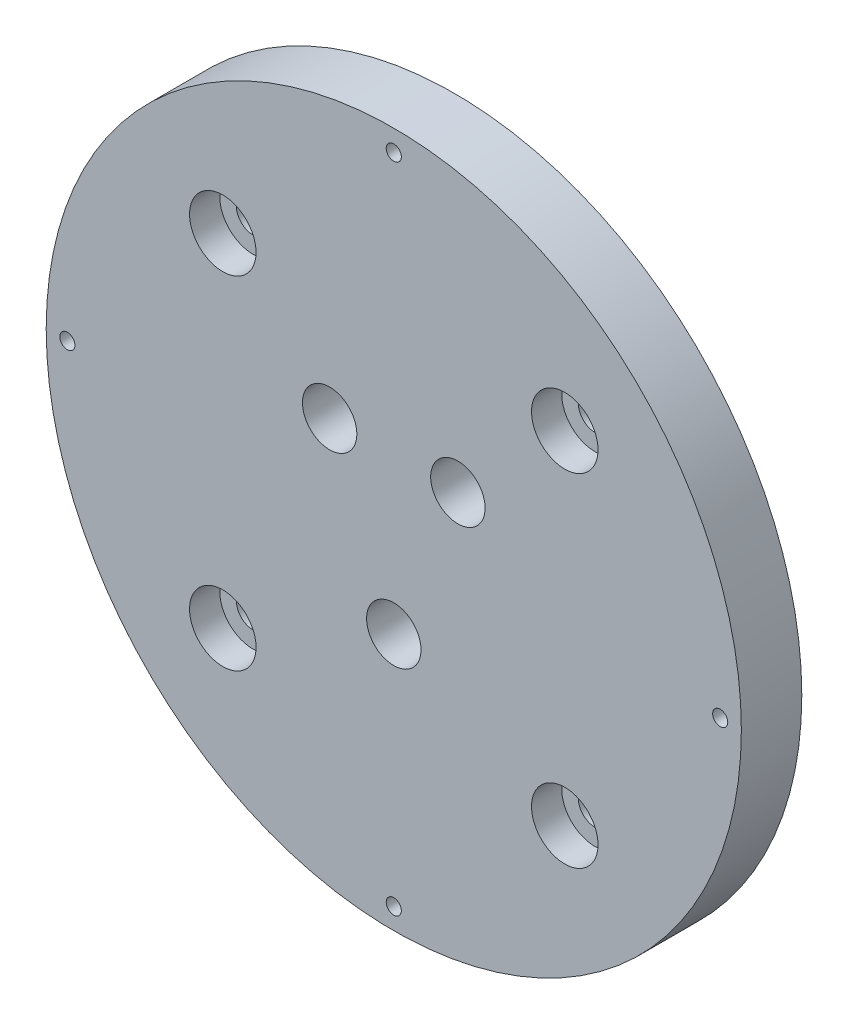
ISO-10303-21;
HEADER;
FILE_DESCRIPTION(('STEP AP214'),'2;1');
FILE_NAME('part.step','',(''),(''),'','','');
FILE_SCHEMA(('AUTOMOTIVE_DESIGN { 1 0 10303 214 1 1 1 1 }'));
ENDSEC;
DATA;
#1=APPLICATION_CONTEXT('core data for automotive mechanical design processes');
#2=APPLICATION_PROTOCOL_DEFINITION('international standard','automotive_design',2000,#1);
#3=PRODUCT_CONTEXT('',#1,'mechanical');
#4=PRODUCT('Part','Part','',(#3));
#5=PRODUCT_RELATED_PRODUCT_CATEGORY('part','',(#4));
#6=PRODUCT_DEFINITION_FORMATION('','',#4);
#7=PRODUCT_DEFINITION_CONTEXT('part definition',#1,'design');
#8=PRODUCT_DEFINITION('design','',#6,#7);
#9=PRODUCT_DEFINITION_SHAPE('','',#8);
#10=(LENGTH_UNIT() NAMED_UNIT(*) SI_UNIT(.MILLI.,.METRE.));
#11=(NAMED_UNIT(*) PLANE_ANGLE_UNIT() SI_UNIT($,.RADIAN.));
#12=(NAMED_UNIT(*) SI_UNIT($,.STERADIAN.) SOLID_ANGLE_UNIT());
#13=UNCERTAINTY_MEASURE_WITH_UNIT(LENGTH_MEASURE(1.E-05),#10,'distance_accuracy_value','');
#14=(GEOMETRIC_REPRESENTATION_CONTEXT(3) GLOBAL_UNCERTAINTY_ASSIGNED_CONTEXT((#13)) GLOBAL_UNIT_ASSIGNED_CONTEXT((#10,
#11,#12)) REPRESENTATION_CONTEXT('',''));
#15=CARTESIAN_POINT('',(0.,0.,0.));
#16=DIRECTION('',(0.,0.,1.));
#17=DIRECTION('',(1.,0.,0.));
#18=AXIS2_PLACEMENT_3D('',#15,#16,#17);
#19=CARTESIAN_POINT('',(0.,0.,0.));
#20=DIRECTION('',(0.,0.,1.));
#21=DIRECTION('',(1.,0.,0.));
#22=AXIS2_PLACEMENT_3D('',#19,#20,#21);
#23=PLANE('',#22);
#24=CARTESIAN_POINT('',(28.2842712474622,-28.2842712474616,0.));
#25=DIRECTION('',(0.,0.,1.));
#26=DIRECTION('',(1.,0.,0.));
#27=AXIS2_PLACEMENT_3D('',#24,#25,#26);
#28=CIRCLE('',#27,2.75000000000001);
#29=CARTESIAN_POINT('',(31.0342712474623,-28.2842712474616,0.));
#30=VERTEX_POINT('',#29);
#31=EDGE_CURVE('E157',#30,#30,#28,.T.);
#32=ORIENTED_EDGE('',*,*,#31,.T.);
#33=EDGE_LOOP('',(#32));
#34=FACE_BOUND('',#33,.T.);
#35=CARTESIAN_POINT('',(-28.2842712474618,-28.284271247462,0.));
#36=DIRECTION('',(0.,0.,1.));
#37=DIRECTION('',(1.,0.,0.));
#38=AXIS2_PLACEMENT_3D('',#35,#36,#37);
#39=CIRCLE('',#38,2.75000000000001);
#40=CARTESIAN_POINT('',(-25.5342712474618,-28.284271247462,0.));
#41=VERTEX_POINT('',#40);
#42=EDGE_CURVE('E161',#41,#41,#39,.T.);
#43=ORIENTED_EDGE('',*,*,#42,.T.);
#44=EDGE_LOOP('',(#43));
#45=FACE_BOUND('',#44,.T.);
#46=CARTESIAN_POINT('',(-28.2842712474621,28.2842712474617,0.));
#47=DIRECTION('',(0.,0.,1.));
#48=DIRECTION('',(1.,0.,0.));
#49=AXIS2_PLACEMENT_3D('',#46,#47,#48);
#50=CIRCLE('',#49,2.75000000000001);
#51=CARTESIAN_POINT('',(-25.534271247462,28.2842712474617,0.));
#52=VERTEX_POINT('',#51);
#53=EDGE_CURVE('E165',#52,#52,#50,.T.);
#54=ORIENTED_EDGE('',*,*,#53,.T.);
#55=EDGE_LOOP('',(#54));
#56=FACE_BOUND('',#55,.T.);
#57=CARTESIAN_POINT('',(28.2842712474618,28.284271247462,0.));
#58=DIRECTION('',(0.,0.,1.));
#59=DIRECTION('',(1.,0.,0.));
#60=AXIS2_PLACEMENT_3D('',#57,#58,#59);
#61=CIRCLE('',#60,2.75000000000001);
#62=CARTESIAN_POINT('',(31.0342712474619,28.284271247462,0.));
#63=VERTEX_POINT('',#62);
#64=EDGE_CURVE('E77',#63,#63,#61,.T.);
#65=ORIENTED_EDGE('',*,*,#64,.T.);
#66=EDGE_LOOP('',(#65));
#67=FACE_BOUND('',#66,.T.);
#68=CARTESIAN_POINT('',(-10.6066017177983,10.6066017177982,0.));
#69=DIRECTION('',(0.,0.,1.));
#70=DIRECTION('',(1.,0.,0.));
#71=AXIS2_PLACEMENT_3D('',#68,#69,#70);
#72=CIRCLE('',#71,4.5);
#73=CARTESIAN_POINT('',(-6.10660171779827,10.6066017177982,0.));
#74=VERTEX_POINT('',#73);
#75=EDGE_CURVE('E120',#74,#74,#72,.T.);
#76=ORIENTED_EDGE('',*,*,#75,.T.);
#77=EDGE_LOOP('',(#76));
#78=FACE_BOUND('',#77,.T.);
#79=CARTESIAN_POINT('',(10.6066017177982,10.6066017177982,0.));
#80=DIRECTION('',(0.,0.,1.));
#81=DIRECTION('',(1.,0.,0.));
#82=AXIS2_PLACEMENT_3D('',#79,#80,#81);
#83=CIRCLE('',#82,4.5);
#84=CARTESIAN_POINT('',(15.1066017177982,10.6066017177982,0.));
#85=VERTEX_POINT('',#84);
#86=EDGE_CURVE('E114',#85,#85,#83,.T.);
#87=ORIENTED_EDGE('',*,*,#86,.T.);
#88=EDGE_LOOP('',(#87));
#89=FACE_BOUND('',#88,.T.);
#90=CARTESIAN_POINT('',(0.,-15.,0.));
#91=DIRECTION('',(0.,0.,1.));
#92=DIRECTION('',(1.,0.,0.));
#93=AXIS2_PLACEMENT_3D('',#90,#91,#92);
#94=CIRCLE('',#93,4.5);
#95=CARTESIAN_POINT('',(4.5,-15.,0.));
#96=VERTEX_POINT('',#95);
#97=EDGE_CURVE('E108',#96,#96,#94,.T.);
#98=ORIENTED_EDGE('',*,*,#97,.T.);
#99=EDGE_LOOP('',(#98));
#100=FACE_BOUND('',#99,.T.);
#101=CARTESIAN_POINT('',(0.,0.,0.));
#102=DIRECTION('',(0.,0.,-1.));
#103=DIRECTION('',(-1.,0.,0.));
#104=AXIS2_PLACEMENT_3D('',#101,#102,#103);
#105=CIRCLE('',#104,53.);
#106=CARTESIAN_POINT('',(-53.,0.,0.));
#107=VERTEX_POINT('',#106);
#108=EDGE_CURVE('E95',#107,#107,#105,.T.);
#109=ORIENTED_EDGE('',*,*,#108,.T.);
#110=EDGE_LOOP('',(#109));
#111=FACE_BOUND('',#110,.T.);
#112=ADVANCED_FACE('F39',(#34,#45,#56,#67,#78,#89,#100,#111),#23,.F.);
#113=CARTESIAN_POINT('',(0.,0.,10.));
#114=DIRECTION('',(0.,0.,-1.));
#115=DIRECTION('',(-1.,0.,0.));
#116=AXIS2_PLACEMENT_3D('',#113,#114,#115);
#117=CYLINDRICAL_SURFACE('',#116,57.5);
#118=CARTESIAN_POINT('',(0.,0.,10.));
#119=DIRECTION('',(0.,0.,1.));
#120=DIRECTION('',(1.,0.,0.));
#121=AXIS2_PLACEMENT_3D('',#118,#119,#120);
#122=CIRCLE('',#121,57.5);
#123=CARTESIAN_POINT('',(57.5,0.,10.));
#124=VERTEX_POINT('',#123);
#125=EDGE_CURVE('E11',#124,#124,#122,.T.);
#126=ORIENTED_EDGE('',*,*,#125,.F.);
#127=EDGE_LOOP('',(#126));
#128=FACE_BOUND('',#127,.T.);
#129=CARTESIAN_POINT('',(0.,0.,0.));
#130=DIRECTION('',(0.,0.,1.));
#131=DIRECTION('',(1.,0.,0.));
#132=AXIS2_PLACEMENT_3D('',#129,#130,#131);
#133=CIRCLE('',#132,57.5);
#134=CARTESIAN_POINT('',(57.5,0.,0.));
#135=VERTEX_POINT('',#134);
#136=EDGE_CURVE('E43',#135,#135,#133,.T.);
#137=ORIENTED_EDGE('',*,*,#136,.T.);
#138=EDGE_LOOP('',(#137));
#139=FACE_BOUND('',#138,.T.);
#140=ADVANCED_FACE('F41',(#128,#139),#117,.T.);
#141=CARTESIAN_POINT('',(0.,0.,10.));
#142=DIRECTION('',(0.,0.,1.));
#143=DIRECTION('',(1.,0.,0.));
#144=AXIS2_PLACEMENT_3D('',#141,#142,#143);
#145=PLANE('',#144);
#146=CARTESIAN_POINT('',(28.2842712474622,-28.2842712474616,10.));
#147=DIRECTION('',(0.,0.,1.));
#148=DIRECTION('',(1.,0.,0.));
#149=AXIS2_PLACEMENT_3D('',#146,#147,#148);
#150=CIRCLE('',#149,5.50000000000001);
#151=CARTESIAN_POINT('',(33.7842712474623,-28.2842712474616,10.));
#152=VERTEX_POINT('',#151);
#153=EDGE_CURVE('E442',#152,#152,#150,.T.);
#154=ORIENTED_EDGE('',*,*,#153,.F.);
#155=EDGE_LOOP('',(#154));
#156=FACE_BOUND('',#155,.T.);
#157=CARTESIAN_POINT('',(-28.2842712474618,-28.284271247462,10.));
#158=DIRECTION('',(0.,0.,1.));
#159=DIRECTION('',(1.,0.,0.));
#160=AXIS2_PLACEMENT_3D('',#157,#158,#159);
#161=CIRCLE('',#160,5.50000000000001);
#162=CARTESIAN_POINT('',(-22.7842712474618,-28.284271247462,10.));
#163=VERTEX_POINT('',#162);
#164=EDGE_CURVE('E450',#163,#163,#161,.T.);
#165=ORIENTED_EDGE('',*,*,#164,.F.);
#166=EDGE_LOOP('',(#165));
#167=FACE_BOUND('',#166,.T.);
#168=CARTESIAN_POINT('',(-28.2842712474621,28.2842712474617,10.));
#169=DIRECTION('',(0.,0.,1.));
#170=DIRECTION('',(1.,0.,0.));
#171=AXIS2_PLACEMENT_3D('',#168,#169,#170);
#172=CIRCLE('',#171,5.50000000000001);
#173=CARTESIAN_POINT('',(-22.784271247462,28.2842712474617,10.));
#174=VERTEX_POINT('',#173);
#175=EDGE_CURVE('E460',#174,#174,#172,.T.);
#176=ORIENTED_EDGE('',*,*,#175,.F.);
#177=EDGE_LOOP('',(#176));
#178=FACE_BOUND('',#177,.T.);
#179=CARTESIAN_POINT('',(28.2842712474618,28.284271247462,10.));
#180=DIRECTION('',(0.,0.,1.));
#181=DIRECTION('',(1.,0.,0.));
#182=AXIS2_PLACEMENT_3D('',#179,#180,#181);
#183=CIRCLE('',#182,5.50000000000001);
#184=CARTESIAN_POINT('',(33.7842712474619,28.284271247462,10.));
#185=VERTEX_POINT('',#184);
#186=EDGE_CURVE('E470',#185,#185,#183,.T.);
#187=ORIENTED_EDGE('',*,*,#186,.F.);
#188=EDGE_LOOP('',(#187));
#189=FACE_BOUND('',#188,.T.);
#190=CARTESIAN_POINT('',(54.,5.65619976892588E-13,10.));
#191=DIRECTION('',(0.,0.,1.));
#192=DIRECTION('',(1.,0.,0.));
#193=AXIS2_PLACEMENT_3D('',#190,#191,#192);
#194=CIRCLE('',#193,1.25);
#195=CARTESIAN_POINT('',(55.25,5.65619976892588E-13,10.));
#196=VERTEX_POINT('',#195);
#197=EDGE_CURVE('E71',#196,#196,#194,.T.);
#198=ORIENTED_EDGE('',*,*,#197,.F.);
#199=EDGE_LOOP('',(#198));
#200=FACE_BOUND('',#199,.T.);
#201=CARTESIAN_POINT('',(0.,-54.,10.));
#202=DIRECTION('',(0.,0.,1.));
#203=DIRECTION('',(1.,0.,0.));
#204=AXIS2_PLACEMENT_3D('',#201,#202,#203);
#205=CIRCLE('',#204,1.25);
#206=CARTESIAN_POINT('',(1.25,-54.,10.));
#207=VERTEX_POINT('',#206);
#208=EDGE_CURVE('E70',#207,#207,#205,.T.);
#209=ORIENTED_EDGE('',*,*,#208,.F.);
#210=EDGE_LOOP('',(#209));
#211=FACE_BOUND('',#210,.T.);
#212=CARTESIAN_POINT('',(-54.,-1.88539992297529E-13,10.));
#213=DIRECTION('',(0.,0.,1.));
#214=DIRECTION('',(1.,0.,0.));
#215=AXIS2_PLACEMENT_3D('',#212,#213,#214);
#216=CIRCLE('',#215,1.25);
#217=CARTESIAN_POINT('',(-52.75,-1.88539992297529E-13,10.));
#218=VERTEX_POINT('',#217);
#219=EDGE_CURVE('E83',#218,#218,#216,.T.);
#220=ORIENTED_EDGE('',*,*,#219,.F.);
#221=EDGE_LOOP('',(#220));
#222=FACE_BOUND('',#221,.T.);
#223=CARTESIAN_POINT('',(0.,54.,10.));
#224=DIRECTION('',(0.,0.,1.));
#225=DIRECTION('',(1.,0.,0.));
#226=AXIS2_PLACEMENT_3D('',#223,#224,#225);
#227=CIRCLE('',#226,1.25);
#228=CARTESIAN_POINT('',(1.25,54.,10.));
#229=VERTEX_POINT('',#228);
#230=EDGE_CURVE('E89',#229,#229,#227,.T.);
#231=ORIENTED_EDGE('',*,*,#230,.F.);
#232=EDGE_LOOP('',(#231));
#233=FACE_BOUND('',#232,.T.);
#234=CARTESIAN_POINT('',(0.,-15.,10.));
#235=DIRECTION('',(0.,0.,1.));
#236=DIRECTION('',(1.,0.,0.));
#237=AXIS2_PLACEMENT_3D('',#234,#235,#236);
#238=CIRCLE('',#237,4.5);
#239=CARTESIAN_POINT('',(4.5,-15.,10.));
#240=VERTEX_POINT('',#239);
#241=EDGE_CURVE('E111',#240,#240,#238,.T.);
#242=ORIENTED_EDGE('',*,*,#241,.F.);
#243=EDGE_LOOP('',(#242));
#244=FACE_BOUND('',#243,.T.);
#245=CARTESIAN_POINT('',(10.6066017177982,10.6066017177982,10.));
#246=DIRECTION('',(0.,0.,1.));
#247=DIRECTION('',(1.,0.,0.));
#248=AXIS2_PLACEMENT_3D('',#245,#246,#247);
#249=CIRCLE('',#248,4.5);
#250=CARTESIAN_POINT('',(15.1066017177982,10.6066017177982,10.));
#251=VERTEX_POINT('',#250);
#252=EDGE_CURVE('E117',#251,#251,#249,.T.);
#253=ORIENTED_EDGE('',*,*,#252,.F.);
#254=EDGE_LOOP('',(#253));
#255=FACE_BOUND('',#254,.T.);
#256=CARTESIAN_POINT('',(-10.6066017177983,10.6066017177982,10.));
#257=DIRECTION('',(0.,0.,1.));
#258=DIRECTION('',(1.,0.,0.));
#259=AXIS2_PLACEMENT_3D('',#256,#257,#258);
#260=CIRCLE('',#259,4.5);
#261=CARTESIAN_POINT('',(-6.10660171779827,10.6066017177982,10.));
#262=VERTEX_POINT('',#261);
#263=EDGE_CURVE('E105',#262,#262,#260,.T.);
#264=ORIENTED_EDGE('',*,*,#263,.F.);
#265=EDGE_LOOP('',(#264));
#266=FACE_BOUND('',#265,.T.);
#267=ORIENTED_EDGE('',*,*,#125,.T.);
#268=EDGE_LOOP('',(#267));
#269=FACE_BOUND('',#268,.T.);
#270=ADVANCED_FACE('F128',(#156,#167,#178,#189,#200,#211,#222,#233,#244,#255,#266,#269),#145,.T.);
#271=CARTESIAN_POINT('',(0.,0.,0.));
#272=DIRECTION('',(0.,0.,-1.));
#273=DIRECTION('',(-1.,0.,0.));
#274=AXIS2_PLACEMENT_3D('',#271,#272,#273);
#275=CIRCLE('',#274,55.);
#276=CARTESIAN_POINT('',(-55.,0.,0.));
#277=VERTEX_POINT('',#276);
#278=EDGE_CURVE('E99',#277,#277,#275,.T.);
#279=ORIENTED_EDGE('',*,*,#278,.F.);
#280=EDGE_LOOP('',(#279));
#281=FACE_BOUND('',#280,.T.);
#282=ORIENTED_EDGE('',*,*,#136,.F.);
#283=EDGE_LOOP('',(#282));
#284=FACE_BOUND('',#283,.T.);
#285=ADVANCED_FACE('F131',(#281,#284),#23,.F.);
#286=CARTESIAN_POINT('',(-10.6066017177983,10.6066017177982,0.));
#287=DIRECTION('',(0.,0.,1.));
#288=DIRECTION('',(1.,0.,0.));
#289=AXIS2_PLACEMENT_3D('',#286,#287,#288);
#290=CYLINDRICAL_SURFACE('',#289,4.5);
#291=ORIENTED_EDGE('',*,*,#75,.F.);
#292=EDGE_LOOP('',(#291));
#293=FACE_BOUND('',#292,.T.);
#294=ORIENTED_EDGE('',*,*,#263,.T.);
#295=EDGE_LOOP('',(#294));
#296=FACE_BOUND('',#295,.T.);
#297=ADVANCED_FACE('F126',(#293,#296),#290,.F.);
#298=CARTESIAN_POINT('',(10.6066017177982,10.6066017177982,0.));
#299=DIRECTION('',(0.,0.,1.));
#300=DIRECTION('',(1.,0.,0.));
#301=AXIS2_PLACEMENT_3D('',#298,#299,#300);
#302=CYLINDRICAL_SURFACE('',#301,4.5);
#303=ORIENTED_EDGE('',*,*,#86,.F.);
#304=EDGE_LOOP('',(#303));
#305=FACE_BOUND('',#304,.T.);
#306=ORIENTED_EDGE('',*,*,#252,.T.);
#307=EDGE_LOOP('',(#306));
#308=FACE_BOUND('',#307,.T.);
#309=ADVANCED_FACE('F146',(#305,#308),#302,.F.);
#310=CARTESIAN_POINT('',(0.,-15.,0.));
#311=DIRECTION('',(0.,0.,1.));
#312=DIRECTION('',(1.,0.,0.));
#313=AXIS2_PLACEMENT_3D('',#310,#311,#312);
#314=CYLINDRICAL_SURFACE('',#313,4.5);
#315=ORIENTED_EDGE('',*,*,#97,.F.);
#316=EDGE_LOOP('',(#315));
#317=FACE_BOUND('',#316,.T.);
#318=ORIENTED_EDGE('',*,*,#241,.T.);
#319=EDGE_LOOP('',(#318));
#320=FACE_BOUND('',#319,.T.);
#321=ADVANCED_FACE('F196',(#317,#320),#314,.F.);
#322=CARTESIAN_POINT('',(0.,0.,1.27));
#323=DIRECTION('',(0.,0.,-1.));
#324=DIRECTION('',(-1.,0.,0.));
#325=AXIS2_PLACEMENT_3D('',#322,#323,#324);
#326=CYLINDRICAL_SURFACE('',#325,55.);
#327=CARTESIAN_POINT('',(0.,0.,1.27));
#328=DIRECTION('',(0.,0.,-1.));
#329=DIRECTION('',(-1.,0.,0.));
#330=AXIS2_PLACEMENT_3D('',#327,#328,#329);
#331=CIRCLE('',#330,55.);
#332=CARTESIAN_POINT('',(-55.,0.,1.27));
#333=VERTEX_POINT('',#332);
#334=EDGE_CURVE('E102',#333,#333,#331,.T.);
#335=ORIENTED_EDGE('',*,*,#334,.F.);
#336=EDGE_LOOP('',(#335));
#337=FACE_BOUND('',#336,.T.);
#338=ORIENTED_EDGE('',*,*,#278,.T.);
#339=EDGE_LOOP('',(#338));
#340=FACE_BOUND('',#339,.T.);
#341=ADVANCED_FACE('F189',(#337,#340),#326,.F.);
#342=CARTESIAN_POINT('',(0.,0.,1.27));
#343=DIRECTION('',(0.,0.,-1.));
#344=DIRECTION('',(-1.,0.,0.));
#345=AXIS2_PLACEMENT_3D('',#342,#343,#344);
#346=PLANE('',#345);
#347=CARTESIAN_POINT('',(0.,0.,1.27));
#348=DIRECTION('',(0.,0.,-1.));
#349=DIRECTION('',(-1.,0.,0.));
#350=AXIS2_PLACEMENT_3D('',#347,#348,#349);
#351=CIRCLE('',#350,53.);
#352=CARTESIAN_POINT('',(-53.,0.,1.27));
#353=VERTEX_POINT('',#352);
#354=EDGE_CURVE('E96',#353,#353,#351,.T.);
#355=ORIENTED_EDGE('',*,*,#354,.F.);
#356=EDGE_LOOP('',(#355));
#357=FACE_BOUND('',#356,.T.);
#358=ORIENTED_EDGE('',*,*,#334,.T.);
#359=EDGE_LOOP('',(#358));
#360=FACE_BOUND('',#359,.T.);
#361=ADVANCED_FACE('F180',(#357,#360),#346,.T.);
#362=CARTESIAN_POINT('',(0.,0.,1.27));
#363=DIRECTION('',(0.,0.,-1.));
#364=DIRECTION('',(-1.,0.,0.));
#365=AXIS2_PLACEMENT_3D('',#362,#363,#364);
#366=CYLINDRICAL_SURFACE('',#365,53.);
#367=ORIENTED_EDGE('',*,*,#354,.T.);
#368=EDGE_LOOP('',(#367));
#369=FACE_BOUND('',#368,.T.);
#370=ORIENTED_EDGE('',*,*,#108,.F.);
#371=EDGE_LOOP('',(#370));
#372=FACE_BOUND('',#371,.T.);
#373=ADVANCED_FACE('F177',(#369,#372),#366,.T.);
#374=CARTESIAN_POINT('',(0.,54.,3.5));
#375=DIRECTION('',(0.,0.,1.));
#376=DIRECTION('',(1.,0.,0.));
#377=AXIS2_PLACEMENT_3D('',#374,#375,#376);
#378=CONICAL_SURFACE('',#377,1.25,1.02974425867665);
#379=CARTESIAN_POINT('',(0.,54.,2.74892422621555));
#380=VERTEX_POINT('',#379);
#381=VERTEX_LOOP('',#380);
#382=FACE_BOUND('',#381,.T.);
#383=CARTESIAN_POINT('',(0.,54.,3.5));
#384=DIRECTION('',(0.,0.,1.));
#385=DIRECTION('',(1.,0.,0.));
#386=AXIS2_PLACEMENT_3D('',#383,#384,#385);
#387=CIRCLE('',#386,1.25);
#388=CARTESIAN_POINT('',(1.25,54.,3.5));
#389=VERTEX_POINT('',#388);
#390=EDGE_CURVE('E92',#389,#389,#387,.T.);
#391=ORIENTED_EDGE('',*,*,#390,.T.);
#392=EDGE_LOOP('',(#391));
#393=FACE_BOUND('',#392,.T.);
#394=ADVANCED_FACE('F179',(#382,#393),#378,.F.);
#395=CARTESIAN_POINT('',(0.,54.,10.));
#396=DIRECTION('',(0.,0.,1.));
#397=DIRECTION('',(1.,0.,0.));
#398=AXIS2_PLACEMENT_3D('',#395,#396,#397);
#399=CYLINDRICAL_SURFACE('',#398,1.25);
#400=ORIENTED_EDGE('',*,*,#390,.F.);
#401=EDGE_LOOP('',(#400));
#402=FACE_BOUND('',#401,.T.);
#403=ORIENTED_EDGE('',*,*,#230,.T.);
#404=EDGE_LOOP('',(#403));
#405=FACE_BOUND('',#404,.T.);
#406=ADVANCED_FACE('F187',(#402,#405),#399,.F.);
#407=CARTESIAN_POINT('',(-54.,-1.88539992297529E-13,3.5));
#408=DIRECTION('',(0.,0.,1.));
#409=DIRECTION('',(1.,0.,0.));
#410=AXIS2_PLACEMENT_3D('',#407,#408,#409);
#411=CONICAL_SURFACE('',#410,1.25,1.02974425867666);
#412=CARTESIAN_POINT('',(-54.,-1.88539992297529E-13,2.74892422621555));
#413=VERTEX_POINT('',#412);
#414=VERTEX_LOOP('',#413);
#415=FACE_BOUND('',#414,.T.);
#416=CARTESIAN_POINT('',(-54.,-1.88539992297529E-13,3.5));
#417=DIRECTION('',(0.,0.,1.));
#418=DIRECTION('',(1.,0.,0.));
#419=AXIS2_PLACEMENT_3D('',#416,#417,#418);
#420=CIRCLE('',#419,1.25);
#421=CARTESIAN_POINT('',(-52.75,-1.88539992297529E-13,3.5));
#422=VERTEX_POINT('',#421);
#423=EDGE_CURVE('E86',#422,#422,#420,.T.);
#424=ORIENTED_EDGE('',*,*,#423,.T.);
#425=EDGE_LOOP('',(#424));
#426=FACE_BOUND('',#425,.T.);
#427=ADVANCED_FACE('F242',(#415,#426),#411,.F.);
#428=CARTESIAN_POINT('',(-54.,-1.88539992297529E-13,10.));
#429=DIRECTION('',(0.,0.,1.));
#430=DIRECTION('',(1.,0.,0.));
#431=AXIS2_PLACEMENT_3D('',#428,#429,#430);
#432=CYLINDRICAL_SURFACE('',#431,1.25);
#433=ORIENTED_EDGE('',*,*,#423,.F.);
#434=EDGE_LOOP('',(#433));
#435=FACE_BOUND('',#434,.T.);
#436=ORIENTED_EDGE('',*,*,#219,.T.);
#437=EDGE_LOOP('',(#436));
#438=FACE_BOUND('',#437,.T.);
#439=ADVANCED_FACE('F253',(#435,#438),#432,.F.);
#440=CARTESIAN_POINT('',(0.,-54.,3.5));
#441=DIRECTION('',(0.,0.,1.));
#442=DIRECTION('',(1.,0.,0.));
#443=AXIS2_PLACEMENT_3D('',#440,#441,#442);
#444=CONICAL_SURFACE('',#443,1.25,1.02974425867665);
#445=CARTESIAN_POINT('',(0.,-54.,2.74892422621555));
#446=VERTEX_POINT('',#445);
#447=VERTEX_LOOP('',#446);
#448=FACE_BOUND('',#447,.T.);
#449=CARTESIAN_POINT('',(0.,-54.,3.5));
#450=DIRECTION('',(0.,0.,1.));
#451=DIRECTION('',(1.,0.,0.));
#452=AXIS2_PLACEMENT_3D('',#449,#450,#451);
#453=CIRCLE('',#452,1.25);
#454=CARTESIAN_POINT('',(1.25,-54.,3.5));
#455=VERTEX_POINT('',#454);
#456=EDGE_CURVE('E74',#455,#455,#453,.T.);
#457=ORIENTED_EDGE('',*,*,#456,.T.);
#458=EDGE_LOOP('',(#457));
#459=FACE_BOUND('',#458,.T.);
#460=ADVANCED_FACE('F263',(#448,#459),#444,.F.);
#461=CARTESIAN_POINT('',(0.,-54.,10.));
#462=DIRECTION('',(0.,0.,1.));
#463=DIRECTION('',(1.,0.,0.));
#464=AXIS2_PLACEMENT_3D('',#461,#462,#463);
#465=CYLINDRICAL_SURFACE('',#464,1.25);
#466=ORIENTED_EDGE('',*,*,#456,.F.);
#467=EDGE_LOOP('',(#466));
#468=FACE_BOUND('',#467,.T.);
#469=ORIENTED_EDGE('',*,*,#208,.T.);
#470=EDGE_LOOP('',(#469));
#471=FACE_BOUND('',#470,.T.);
#472=ADVANCED_FACE('F64',(#468,#471),#465,.F.);
#473=CARTESIAN_POINT('',(54.,5.65619976892588E-13,3.5));
#474=DIRECTION('',(0.,0.,1.));
#475=DIRECTION('',(1.,0.,0.));
#476=AXIS2_PLACEMENT_3D('',#473,#474,#475);
#477=CONICAL_SURFACE('',#476,1.25,1.02974425867666);
#478=CARTESIAN_POINT('',(54.,5.65619976892588E-13,2.74892422621555));
#479=VERTEX_POINT('',#478);
#480=VERTEX_LOOP('',#479);
#481=FACE_BOUND('',#480,.T.);
#482=CARTESIAN_POINT('',(54.,5.65619976892588E-13,3.5));
#483=DIRECTION('',(0.,0.,1.));
#484=DIRECTION('',(1.,0.,0.));
#485=AXIS2_PLACEMENT_3D('',#482,#483,#484);
#486=CIRCLE('',#485,1.25);
#487=CARTESIAN_POINT('',(55.25,5.65619976892588E-13,3.5));
#488=VERTEX_POINT('',#487);
#489=EDGE_CURVE('E68',#488,#488,#486,.T.);
#490=ORIENTED_EDGE('',*,*,#489,.T.);
#491=EDGE_LOOP('',(#490));
#492=FACE_BOUND('',#491,.T.);
#493=ADVANCED_FACE('F60',(#481,#492),#477,.F.);
#494=CARTESIAN_POINT('',(54.,5.65619976892588E-13,10.));
#495=DIRECTION('',(0.,0.,1.));
#496=DIRECTION('',(1.,0.,0.));
#497=AXIS2_PLACEMENT_3D('',#494,#495,#496);
#498=CYLINDRICAL_SURFACE('',#497,1.25);
#499=ORIENTED_EDGE('',*,*,#489,.F.);
#500=EDGE_LOOP('',(#499));
#501=FACE_BOUND('',#500,.T.);
#502=ORIENTED_EDGE('',*,*,#197,.T.);
#503=EDGE_LOOP('',(#502));
#504=FACE_BOUND('',#503,.T.);
#505=ADVANCED_FACE('F63',(#501,#504),#498,.F.);
#506=CARTESIAN_POINT('',(28.2842712474618,28.284271247462,10.));
#507=DIRECTION('',(0.,0.,1.));
#508=DIRECTION('',(1.,0.,0.));
#509=AXIS2_PLACEMENT_3D('',#506,#507,#508);
#510=CYLINDRICAL_SURFACE('',#509,2.75000000000001);
#511=ORIENTED_EDGE('',*,*,#64,.F.);
#512=EDGE_LOOP('',(#511));
#513=FACE_BOUND('',#512,.T.);
#514=CARTESIAN_POINT('',(28.2842712474618,28.284271247462,5.));
#515=DIRECTION('',(0.,0.,1.));
#516=DIRECTION('',(1.,0.,0.));
#517=AXIS2_PLACEMENT_3D('',#514,#515,#516);
#518=CIRCLE('',#517,2.75000000000001);
#519=CARTESIAN_POINT('',(31.0342712474619,28.284271247462,5.));
#520=VERTEX_POINT('',#519);
#521=EDGE_CURVE('E476',#520,#520,#518,.T.);
#522=ORIENTED_EDGE('',*,*,#521,.T.);
#523=EDGE_LOOP('',(#522));
#524=FACE_BOUND('',#523,.T.);
#525=ADVANCED_FACE('F300',(#513,#524),#510,.F.);
#526=CARTESIAN_POINT('',(31.0342712474619,28.284271247462,5.));
#527=DIRECTION('',(0.,0.,-1.));
#528=DIRECTION('',(-1.,0.,0.));
#529=AXIS2_PLACEMENT_3D('',#526,#527,#528);
#530=PLANE('',#529);
#531=ORIENTED_EDGE('',*,*,#521,.F.);
#532=EDGE_LOOP('',(#531));
#533=FACE_BOUND('',#532,.T.);
#534=CARTESIAN_POINT('',(28.2842712474618,28.284271247462,5.));
#535=DIRECTION('',(0.,0.,1.));
#536=DIRECTION('',(1.,0.,0.));
#537=AXIS2_PLACEMENT_3D('',#534,#535,#536);
#538=CIRCLE('',#537,5.50000000000002);
#539=CARTESIAN_POINT('',(33.7842712474619,28.284271247462,5.));
#540=VERTEX_POINT('',#539);
#541=EDGE_CURVE('E473',#540,#540,#538,.T.);
#542=ORIENTED_EDGE('',*,*,#541,.T.);
#543=EDGE_LOOP('',(#542));
#544=FACE_BOUND('',#543,.T.);
#545=ADVANCED_FACE('F310',(#533,#544),#530,.F.);
#546=CARTESIAN_POINT('',(28.2842712474618,28.284271247462,10.));
#547=DIRECTION('',(0.,0.,1.));
#548=DIRECTION('',(1.,0.,0.));
#549=AXIS2_PLACEMENT_3D('',#546,#547,#548);
#550=CYLINDRICAL_SURFACE('',#549,5.50000000000001);
#551=ORIENTED_EDGE('',*,*,#541,.F.);
#552=EDGE_LOOP('',(#551));
#553=FACE_BOUND('',#552,.T.);
#554=ORIENTED_EDGE('',*,*,#186,.T.);
#555=EDGE_LOOP('',(#554));
#556=FACE_BOUND('',#555,.T.);
#557=ADVANCED_FACE('F320',(#553,#556),#550,.F.);
#558=CARTESIAN_POINT('',(-28.2842712474621,28.2842712474617,10.));
#559=DIRECTION('',(0.,0.,1.));
#560=DIRECTION('',(1.,0.,0.));
#561=AXIS2_PLACEMENT_3D('',#558,#559,#560);
#562=CYLINDRICAL_SURFACE('',#561,2.75000000000001);
#563=ORIENTED_EDGE('',*,*,#53,.F.);
#564=EDGE_LOOP('',(#563));
#565=FACE_BOUND('',#564,.T.);
#566=CARTESIAN_POINT('',(-28.2842712474621,28.2842712474617,5.));
#567=DIRECTION('',(0.,0.,1.));
#568=DIRECTION('',(1.,0.,0.));
#569=AXIS2_PLACEMENT_3D('',#566,#567,#568);
#570=CIRCLE('',#569,2.75000000000001);
#571=CARTESIAN_POINT('',(-25.534271247462,28.2842712474617,5.));
#572=VERTEX_POINT('',#571);
#573=EDGE_CURVE('E466',#572,#572,#570,.T.);
#574=ORIENTED_EDGE('',*,*,#573,.T.);
#575=EDGE_LOOP('',(#574));
#576=FACE_BOUND('',#575,.T.);
#577=ADVANCED_FACE('F329',(#565,#576),#562,.F.);
#578=CARTESIAN_POINT('',(-25.534271247462,28.2842712474617,5.));
#579=DIRECTION('',(0.,0.,-1.));
#580=DIRECTION('',(-1.,0.,0.));
#581=AXIS2_PLACEMENT_3D('',#578,#579,#580);
#582=PLANE('',#581);
#583=ORIENTED_EDGE('',*,*,#573,.F.);
#584=EDGE_LOOP('',(#583));
#585=FACE_BOUND('',#584,.T.);
#586=CARTESIAN_POINT('',(-28.2842712474621,28.2842712474617,5.));
#587=DIRECTION('',(0.,0.,1.));
#588=DIRECTION('',(1.,0.,0.));
#589=AXIS2_PLACEMENT_3D('',#586,#587,#588);
#590=CIRCLE('',#589,5.50000000000001);
#591=CARTESIAN_POINT('',(-22.784271247462,28.2842712474617,5.));
#592=VERTEX_POINT('',#591);
#593=EDGE_CURVE('E463',#592,#592,#590,.T.);
#594=ORIENTED_EDGE('',*,*,#593,.T.);
#595=EDGE_LOOP('',(#594));
#596=FACE_BOUND('',#595,.T.);
#597=ADVANCED_FACE('F352',(#585,#596),#582,.F.);
#598=CARTESIAN_POINT('',(-28.2842712474621,28.2842712474617,10.));
#599=DIRECTION('',(0.,0.,1.));
#600=DIRECTION('',(1.,0.,0.));
#601=AXIS2_PLACEMENT_3D('',#598,#599,#600);
#602=CYLINDRICAL_SURFACE('',#601,5.50000000000001);
#603=ORIENTED_EDGE('',*,*,#593,.F.);
#604=EDGE_LOOP('',(#603));
#605=FACE_BOUND('',#604,.T.);
#606=ORIENTED_EDGE('',*,*,#175,.T.);
#607=EDGE_LOOP('',(#606));
#608=FACE_BOUND('',#607,.T.);
#609=ADVANCED_FACE('F362',(#605,#608),#602,.F.);
#610=CARTESIAN_POINT('',(-28.2842712474618,-28.284271247462,10.));
#611=DIRECTION('',(0.,0.,1.));
#612=DIRECTION('',(1.,0.,0.));
#613=AXIS2_PLACEMENT_3D('',#610,#611,#612);
#614=CYLINDRICAL_SURFACE('',#613,2.75000000000001);
#615=ORIENTED_EDGE('',*,*,#42,.F.);
#616=EDGE_LOOP('',(#615));
#617=FACE_BOUND('',#616,.T.);
#618=CARTESIAN_POINT('',(-28.2842712474618,-28.284271247462,5.));
#619=DIRECTION('',(0.,0.,1.));
#620=DIRECTION('',(1.,0.,0.));
#621=AXIS2_PLACEMENT_3D('',#618,#619,#620);
#622=CIRCLE('',#621,2.75000000000001);
#623=CARTESIAN_POINT('',(-25.5342712474618,-28.284271247462,5.));
#624=VERTEX_POINT('',#623);
#625=EDGE_CURVE('E456',#624,#624,#622,.T.);
#626=ORIENTED_EDGE('',*,*,#625,.T.);
#627=EDGE_LOOP('',(#626));
#628=FACE_BOUND('',#627,.T.);
#629=ADVANCED_FACE('F372',(#617,#628),#614,.F.);
#630=CARTESIAN_POINT('',(-25.5342712474618,-28.284271247462,5.));
#631=DIRECTION('',(0.,0.,-1.));
#632=DIRECTION('',(-1.,0.,0.));
#633=AXIS2_PLACEMENT_3D('',#630,#631,#632);
#634=PLANE('',#633);
#635=ORIENTED_EDGE('',*,*,#625,.F.);
#636=EDGE_LOOP('',(#635));
#637=FACE_BOUND('',#636,.T.);
#638=CARTESIAN_POINT('',(-28.2842712474618,-28.284271247462,5.));
#639=DIRECTION('',(0.,0.,1.));
#640=DIRECTION('',(1.,0.,0.));
#641=AXIS2_PLACEMENT_3D('',#638,#639,#640);
#642=CIRCLE('',#641,5.50000000000002);
#643=CARTESIAN_POINT('',(-22.7842712474618,-28.284271247462,5.));
#644=VERTEX_POINT('',#643);
#645=EDGE_CURVE('E453',#644,#644,#642,.T.);
#646=ORIENTED_EDGE('',*,*,#645,.T.);
#647=EDGE_LOOP('',(#646));
#648=FACE_BOUND('',#647,.T.);
#649=ADVANCED_FACE('F382',(#637,#648),#634,.F.);
#650=CARTESIAN_POINT('',(-28.2842712474618,-28.284271247462,10.));
#651=DIRECTION('',(0.,0.,1.));
#652=DIRECTION('',(1.,0.,0.));
#653=AXIS2_PLACEMENT_3D('',#650,#651,#652);
#654=CYLINDRICAL_SURFACE('',#653,5.50000000000001);
#655=ORIENTED_EDGE('',*,*,#645,.F.);
#656=EDGE_LOOP('',(#655));
#657=FACE_BOUND('',#656,.T.);
#658=ORIENTED_EDGE('',*,*,#164,.T.);
#659=EDGE_LOOP('',(#658));
#660=FACE_BOUND('',#659,.T.);
#661=ADVANCED_FACE('F392',(#657,#660),#654,.F.);
#662=CARTESIAN_POINT('',(28.2842712474622,-28.2842712474616,10.));
#663=DIRECTION('',(0.,0.,1.));
#664=DIRECTION('',(1.,0.,0.));
#665=AXIS2_PLACEMENT_3D('',#662,#663,#664);
#666=CYLINDRICAL_SURFACE('',#665,2.75000000000001);
#667=ORIENTED_EDGE('',*,*,#31,.F.);
#668=EDGE_LOOP('',(#667));
#669=FACE_BOUND('',#668,.T.);
#670=CARTESIAN_POINT('',(28.2842712474622,-28.2842712474616,5.));
#671=DIRECTION('',(0.,0.,1.));
#672=DIRECTION('',(1.,0.,0.));
#673=AXIS2_PLACEMENT_3D('',#670,#671,#672);
#674=CIRCLE('',#673,2.75000000000001);
#675=CARTESIAN_POINT('',(31.0342712474623,-28.2842712474616,5.));
#676=VERTEX_POINT('',#675);
#677=EDGE_CURVE('E444',#676,#676,#674,.T.);
#678=ORIENTED_EDGE('',*,*,#677,.T.);
#679=EDGE_LOOP('',(#678));
#680=FACE_BOUND('',#679,.T.);
#681=ADVANCED_FACE('F402',(#669,#680),#666,.F.);
#682=CARTESIAN_POINT('',(31.0342712474623,-28.2842712474616,5.));
#683=DIRECTION('',(0.,0.,-1.));
#684=DIRECTION('',(-1.,0.,0.));
#685=AXIS2_PLACEMENT_3D('',#682,#683,#684);
#686=PLANE('',#685);
#687=ORIENTED_EDGE('',*,*,#677,.F.);
#688=EDGE_LOOP('',(#687));
#689=FACE_BOUND('',#688,.T.);
#690=CARTESIAN_POINT('',(28.2842712474622,-28.2842712474616,5.));
#691=DIRECTION('',(0.,0.,1.));
#692=DIRECTION('',(1.,0.,0.));
#693=AXIS2_PLACEMENT_3D('',#690,#691,#692);
#694=CIRCLE('',#693,5.50000000000002);
#695=CARTESIAN_POINT('',(33.7842712474623,-28.2842712474616,5.));
#696=VERTEX_POINT('',#695);
#697=EDGE_CURVE('E439',#696,#696,#694,.T.);
#698=ORIENTED_EDGE('',*,*,#697,.T.);
#699=EDGE_LOOP('',(#698));
#700=FACE_BOUND('',#699,.T.);
#701=ADVANCED_FACE('F412',(#689,#700),#686,.F.);
#702=CARTESIAN_POINT('',(28.2842712474622,-28.2842712474616,10.));
#703=DIRECTION('',(0.,0.,1.));
#704=DIRECTION('',(1.,0.,0.));
#705=AXIS2_PLACEMENT_3D('',#702,#703,#704);
#706=CYLINDRICAL_SURFACE('',#705,5.50000000000001);
#707=ORIENTED_EDGE('',*,*,#697,.F.);
#708=EDGE_LOOP('',(#707));
#709=FACE_BOUND('',#708,.T.);
#710=ORIENTED_EDGE('',*,*,#153,.T.);
#711=EDGE_LOOP('',(#710));
#712=FACE_BOUND('',#711,.T.);
#713=ADVANCED_FACE('F422',(#709,#712),#706,.F.);
#714=CLOSED_SHELL('',(#112,#140,#270,#285,#297,#309,#321,#341,#361,#373,#394,#406,#427,#439,
#460,#472,#493,#505,#525,#545,#557,#577,#597,#609,#629,#649,#661,#681,#701,#713));
#715=MANIFOLD_SOLID_BREP('B2',#714);
#716=ADVANCED_BREP_SHAPE_REPRESENTATION('',(#18,#715),#14);
#717=SHAPE_DEFINITION_REPRESENTATION(#9,#716);
ENDSEC;
END-ISO-10303-21;
